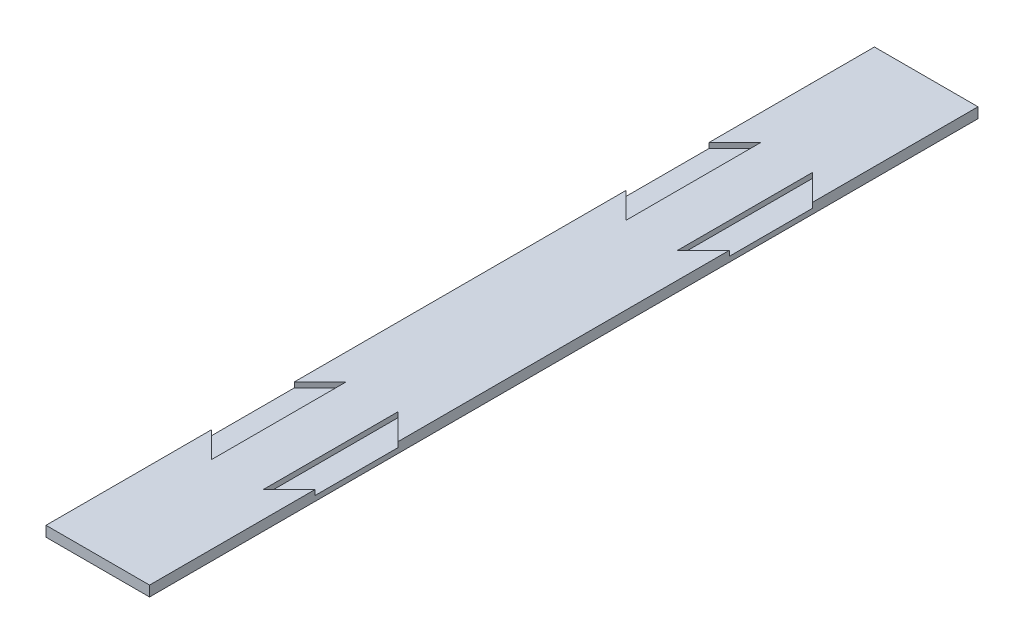
ISO-10303-21;
HEADER;
FILE_DESCRIPTION(('STEP AP214'),'2;1');
FILE_NAME('part.step','',(''),(''),'','','');
FILE_SCHEMA(('AUTOMOTIVE_DESIGN { 1 0 10303 214 1 1 1 1 }'));
ENDSEC;
DATA;
#1=APPLICATION_CONTEXT('core data for automotive mechanical design processes');
#2=APPLICATION_PROTOCOL_DEFINITION('international standard','automotive_design',2000,#1);
#3=PRODUCT_CONTEXT('',#1,'mechanical');
#4=PRODUCT('Part','Part','',(#3));
#5=PRODUCT_RELATED_PRODUCT_CATEGORY('part','',(#4));
#6=PRODUCT_DEFINITION_FORMATION('','',#4);
#7=PRODUCT_DEFINITION_CONTEXT('part definition',#1,'design');
#8=PRODUCT_DEFINITION('design','',#6,#7);
#9=PRODUCT_DEFINITION_SHAPE('','',#8);
#10=(LENGTH_UNIT() NAMED_UNIT(*) SI_UNIT(.MILLI.,.METRE.));
#11=(NAMED_UNIT(*) PLANE_ANGLE_UNIT() SI_UNIT($,.RADIAN.));
#12=(NAMED_UNIT(*) SI_UNIT($,.STERADIAN.) SOLID_ANGLE_UNIT());
#13=UNCERTAINTY_MEASURE_WITH_UNIT(LENGTH_MEASURE(1.E-05),#10,'distance_accuracy_value','');
#14=(GEOMETRIC_REPRESENTATION_CONTEXT(3) GLOBAL_UNCERTAINTY_ASSIGNED_CONTEXT((#13)) GLOBAL_UNIT_ASSIGNED_CONTEXT((#10,
#11,#12)) REPRESENTATION_CONTEXT('',''));
#15=CARTESIAN_POINT('',(0.,0.,0.));
#16=DIRECTION('',(0.,0.,1.));
#17=DIRECTION('',(1.,0.,0.));
#18=AXIS2_PLACEMENT_3D('',#15,#16,#17);
#19=CARTESIAN_POINT('',(12.7,-2.54,101.6));
#20=DIRECTION('',(1.,0.,0.));
#21=DIRECTION('',(0.,0.,-1.));
#22=AXIS2_PLACEMENT_3D('',#19,#20,#21);
#23=PLANE('',#22);
#24=DIRECTION('',(0.,1.,0.));
#25=VECTOR('',#24,1.);
#26=CARTESIAN_POINT('',(12.7,-1.27,40.64));
#27=LINE('',#26,#25);
#28=CARTESIAN_POINT('',(12.7,-1.27,40.64));
#29=VERTEX_POINT('',#28);
#30=CARTESIAN_POINT('',(12.7,0.,40.64));
#31=VERTEX_POINT('',#30);
#32=EDGE_CURVE('E200',#29,#31,#27,.T.);
#33=ORIENTED_EDGE('',*,*,#32,.F.);
#34=DIRECTION('',(0.,0.,-1.));
#35=VECTOR('',#34,1.);
#36=CARTESIAN_POINT('',(12.7,-1.27,60.96));
#37=LINE('',#36,#35);
#38=CARTESIAN_POINT('',(12.7,-1.27,60.96));
#39=VERTEX_POINT('',#38);
#40=EDGE_CURVE('E257',#39,#29,#37,.T.);
#41=ORIENTED_EDGE('',*,*,#40,.F.);
#42=DIRECTION('',(0.,1.,0.));
#43=VECTOR('',#42,1.);
#44=CARTESIAN_POINT('',(12.7,-1.27,60.96));
#45=LINE('',#44,#43);
#46=CARTESIAN_POINT('',(12.7,0.,60.96));
#47=VERTEX_POINT('',#46);
#48=EDGE_CURVE('E244',#39,#47,#45,.T.);
#49=ORIENTED_EDGE('',*,*,#48,.T.);
#50=DIRECTION('',(0.,0.,-1.));
#51=VECTOR('',#50,1.);
#52=CARTESIAN_POINT('',(12.7,0.,101.6));
#53=LINE('',#52,#51);
#54=CARTESIAN_POINT('',(12.7,0.,101.6));
#55=VERTEX_POINT('',#54);
#56=EDGE_CURVE('E306',#55,#47,#53,.T.);
#57=ORIENTED_EDGE('',*,*,#56,.F.);
#58=DIRECTION('',(0.,1.,0.));
#59=VECTOR('',#58,1.);
#60=CARTESIAN_POINT('',(12.7,-2.54,101.6));
#61=LINE('',#60,#59);
#62=CARTESIAN_POINT('',(12.7,-2.54,101.6));
#63=VERTEX_POINT('',#62);
#64=EDGE_CURVE('E11',#63,#55,#61,.T.);
#65=ORIENTED_EDGE('',*,*,#64,.F.);
#66=DIRECTION('',(0.,0.,-1.));
#67=VECTOR('',#66,1.);
#68=CARTESIAN_POINT('',(12.7,-2.54,101.6));
#69=LINE('',#68,#67);
#70=CARTESIAN_POINT('',(12.7,-2.54,-101.6));
#71=VERTEX_POINT('',#70);
#72=EDGE_CURVE('E293',#63,#71,#69,.T.);
#73=ORIENTED_EDGE('',*,*,#72,.T.);
#74=DIRECTION('',(0.,1.,0.));
#75=VECTOR('',#74,1.);
#76=CARTESIAN_POINT('',(12.7,-2.54,-101.6));
#77=LINE('',#76,#75);
#78=CARTESIAN_POINT('',(12.7,0.,-101.6));
#79=VERTEX_POINT('',#78);
#80=EDGE_CURVE('E39',#71,#79,#77,.T.);
#81=ORIENTED_EDGE('',*,*,#80,.T.);
#82=CARTESIAN_POINT('',(12.7,0.,-60.96));
#83=VERTEX_POINT('',#82);
#84=EDGE_CURVE('E287',#83,#79,#53,.T.);
#85=ORIENTED_EDGE('',*,*,#84,.F.);
#86=DIRECTION('',(0.,1.,0.));
#87=VECTOR('',#86,1.);
#88=CARTESIAN_POINT('',(12.7,-1.27,-60.96));
#89=LINE('',#88,#87);
#90=CARTESIAN_POINT('',(12.7,-1.27,-60.96));
#91=VERTEX_POINT('',#90);
#92=EDGE_CURVE('E277',#91,#83,#89,.T.);
#93=ORIENTED_EDGE('',*,*,#92,.F.);
#94=DIRECTION('',(0.,0.,-1.));
#95=VECTOR('',#94,1.);
#96=CARTESIAN_POINT('',(12.7,-1.27,-60.96));
#97=LINE('',#96,#95);
#98=CARTESIAN_POINT('',(12.7,-1.27,-40.64));
#99=VERTEX_POINT('',#98);
#100=EDGE_CURVE('E264',#99,#91,#97,.T.);
#101=ORIENTED_EDGE('',*,*,#100,.F.);
#102=DIRECTION('',(0.,1.,0.));
#103=VECTOR('',#102,1.);
#104=CARTESIAN_POINT('',(12.7,-1.27,-40.64));
#105=LINE('',#104,#103);
#106=CARTESIAN_POINT('',(12.7,0.,-40.64));
#107=VERTEX_POINT('',#106);
#108=EDGE_CURVE('E284',#99,#107,#105,.T.);
#109=ORIENTED_EDGE('',*,*,#108,.T.);
#110=EDGE_CURVE('E310',#31,#107,#53,.T.);
#111=ORIENTED_EDGE('',*,*,#110,.F.);
#112=EDGE_LOOP('',(#33,#41,#49,#57,#65,#73,#81,#85,#93,#101,#109,#111));
#113=FACE_BOUND('',#112,.T.);
#114=ADVANCED_FACE('F36',(#113),#23,.T.);
#115=CARTESIAN_POINT('',(-12.7,-2.54,101.6));
#116=DIRECTION('',(0.,0.,1.));
#117=DIRECTION('',(1.,0.,0.));
#118=AXIS2_PLACEMENT_3D('',#115,#116,#117);
#119=PLANE('',#118);
#120=DIRECTION('',(1.,0.,0.));
#121=VECTOR('',#120,1.);
#122=CARTESIAN_POINT('',(-12.7,0.,101.6));
#123=LINE('',#122,#121);
#124=CARTESIAN_POINT('',(-12.7,0.,101.6));
#125=VERTEX_POINT('',#124);
#126=EDGE_CURVE('E297',#125,#55,#123,.T.);
#127=ORIENTED_EDGE('',*,*,#126,.F.);
#128=DIRECTION('',(0.,1.,0.));
#129=VECTOR('',#128,1.);
#130=CARTESIAN_POINT('',(-12.7,-2.54,101.6));
#131=LINE('',#130,#129);
#132=CARTESIAN_POINT('',(-12.7,-2.54,101.6));
#133=VERTEX_POINT('',#132);
#134=EDGE_CURVE('E44',#133,#125,#131,.T.);
#135=ORIENTED_EDGE('',*,*,#134,.F.);
#136=DIRECTION('',(1.,0.,0.));
#137=VECTOR('',#136,1.);
#138=CARTESIAN_POINT('',(-12.7,-2.54,101.6));
#139=LINE('',#138,#137);
#140=EDGE_CURVE('E303',#133,#63,#139,.T.);
#141=ORIENTED_EDGE('',*,*,#140,.T.);
#142=ORIENTED_EDGE('',*,*,#64,.T.);
#143=EDGE_LOOP('',(#127,#135,#141,#142));
#144=FACE_BOUND('',#143,.T.);
#145=ADVANCED_FACE('F361',(#144),#119,.T.);
#146=CARTESIAN_POINT('',(-12.7,-2.54,101.6));
#147=DIRECTION('',(-1.,0.,0.));
#148=DIRECTION('',(0.,0.,1.));
#149=AXIS2_PLACEMENT_3D('',#146,#147,#148);
#150=PLANE('',#149);
#151=DIRECTION('',(0.,1.,0.));
#152=VECTOR('',#151,1.);
#153=CARTESIAN_POINT('',(-12.7,-1.27,-40.64));
#154=LINE('',#153,#152);
#155=CARTESIAN_POINT('',(-12.7,-1.27,-40.64));
#156=VERTEX_POINT('',#155);
#157=CARTESIAN_POINT('',(-12.7,0.,-40.64));
#158=VERTEX_POINT('',#157);
#159=EDGE_CURVE('E220',#156,#158,#154,.T.);
#160=ORIENTED_EDGE('',*,*,#159,.F.);
#161=DIRECTION('',(0.,0.,1.));
#162=VECTOR('',#161,1.);
#163=CARTESIAN_POINT('',(-12.7,-1.27,-60.96));
#164=LINE('',#163,#162);
#165=CARTESIAN_POINT('',(-12.7,-1.27,-60.96));
#166=VERTEX_POINT('',#165);
#167=EDGE_CURVE('E234',#166,#156,#164,.T.);
#168=ORIENTED_EDGE('',*,*,#167,.F.);
#169=DIRECTION('',(0.,1.,0.));
#170=VECTOR('',#169,1.);
#171=CARTESIAN_POINT('',(-12.7,-1.27,-60.96));
#172=LINE('',#171,#170);
#173=CARTESIAN_POINT('',(-12.7,0.,-60.96));
#174=VERTEX_POINT('',#173);
#175=EDGE_CURVE('E217',#166,#174,#172,.T.);
#176=ORIENTED_EDGE('',*,*,#175,.T.);
#177=DIRECTION('',(0.,0.,1.));
#178=VECTOR('',#177,1.);
#179=CARTESIAN_POINT('',(-12.7,0.,101.6));
#180=LINE('',#179,#178);
#181=CARTESIAN_POINT('',(-12.7,0.,-101.6));
#182=VERTEX_POINT('',#181);
#183=EDGE_CURVE('E314',#182,#174,#180,.T.);
#184=ORIENTED_EDGE('',*,*,#183,.F.);
#185=DIRECTION('',(0.,1.,0.));
#186=VECTOR('',#185,1.);
#187=CARTESIAN_POINT('',(-12.7,-2.54,-101.6));
#188=LINE('',#187,#186);
#189=CARTESIAN_POINT('',(-12.7,-2.54,-101.6));
#190=VERTEX_POINT('',#189);
#191=EDGE_CURVE('E320',#190,#182,#188,.T.);
#192=ORIENTED_EDGE('',*,*,#191,.F.);
#193=DIRECTION('',(0.,0.,1.));
#194=VECTOR('',#193,1.);
#195=CARTESIAN_POINT('',(-12.7,-2.54,101.6));
#196=LINE('',#195,#194);
#197=EDGE_CURVE('E300',#190,#133,#196,.T.);
#198=ORIENTED_EDGE('',*,*,#197,.T.);
#199=ORIENTED_EDGE('',*,*,#134,.T.);
#200=CARTESIAN_POINT('',(-12.7,0.,60.96));
#201=VERTEX_POINT('',#200);
#202=EDGE_CURVE('E313',#201,#125,#180,.T.);
#203=ORIENTED_EDGE('',*,*,#202,.F.);
#204=DIRECTION('',(0.,1.,0.));
#205=VECTOR('',#204,1.);
#206=CARTESIAN_POINT('',(-12.7,-1.27,60.96));
#207=LINE('',#206,#205);
#208=CARTESIAN_POINT('',(-12.7,-1.27,60.96));
#209=VERTEX_POINT('',#208);
#210=EDGE_CURVE('E401',#209,#201,#207,.T.);
#211=ORIENTED_EDGE('',*,*,#210,.F.);
#212=DIRECTION('',(0.,0.,1.));
#213=VECTOR('',#212,1.);
#214=CARTESIAN_POINT('',(-12.7,-1.27,60.96));
#215=LINE('',#214,#213);
#216=CARTESIAN_POINT('',(-12.7,-1.27,40.64));
#217=VERTEX_POINT('',#216);
#218=EDGE_CURVE('E210',#217,#209,#215,.T.);
#219=ORIENTED_EDGE('',*,*,#218,.F.);
#220=DIRECTION('',(0.,1.,0.));
#221=VECTOR('',#220,1.);
#222=CARTESIAN_POINT('',(-12.7,-1.27,40.64));
#223=LINE('',#222,#221);
#224=CARTESIAN_POINT('',(-12.7,0.,40.64));
#225=VERTEX_POINT('',#224);
#226=EDGE_CURVE('E207',#217,#225,#223,.T.);
#227=ORIENTED_EDGE('',*,*,#226,.T.);
#228=EDGE_CURVE('E197',#158,#225,#180,.T.);
#229=ORIENTED_EDGE('',*,*,#228,.F.);
#230=EDGE_LOOP('',(#160,#168,#176,#184,#192,#198,#199,#203,#211,#219,#227,#229));
#231=FACE_BOUND('',#230,.T.);
#232=ADVANCED_FACE('F365',(#231),#150,.T.);
#233=CARTESIAN_POINT('',(-12.7,-2.54,-101.6));
#234=DIRECTION('',(0.,0.,-1.));
#235=DIRECTION('',(-1.,0.,0.));
#236=AXIS2_PLACEMENT_3D('',#233,#234,#235);
#237=PLANE('',#236);
#238=DIRECTION('',(-1.,0.,0.));
#239=VECTOR('',#238,1.);
#240=CARTESIAN_POINT('',(-12.7,0.,-101.6));
#241=LINE('',#240,#239);
#242=EDGE_CURVE('E309',#79,#182,#241,.T.);
#243=ORIENTED_EDGE('',*,*,#242,.F.);
#244=ORIENTED_EDGE('',*,*,#80,.F.);
#245=DIRECTION('',(-1.,0.,0.));
#246=VECTOR('',#245,1.);
#247=CARTESIAN_POINT('',(-12.7,-2.54,-101.6));
#248=LINE('',#247,#246);
#249=EDGE_CURVE('E296',#71,#190,#248,.T.);
#250=ORIENTED_EDGE('',*,*,#249,.T.);
#251=ORIENTED_EDGE('',*,*,#191,.T.);
#252=EDGE_LOOP('',(#243,#244,#250,#251));
#253=FACE_BOUND('',#252,.T.);
#254=ADVANCED_FACE('F331',(#253),#237,.T.);
#255=CARTESIAN_POINT('',(0.,-2.54,0.));
#256=DIRECTION('',(0.,-1.,0.));
#257=DIRECTION('',(0.,0.,-1.));
#258=AXIS2_PLACEMENT_3D('',#255,#256,#257);
#259=PLANE('',#258);
#260=ORIENTED_EDGE('',*,*,#72,.F.);
#261=ORIENTED_EDGE('',*,*,#140,.F.);
#262=ORIENTED_EDGE('',*,*,#197,.F.);
#263=ORIENTED_EDGE('',*,*,#249,.F.);
#264=EDGE_LOOP('',(#260,#261,#262,#263));
#265=FACE_BOUND('',#264,.T.);
#266=ADVANCED_FACE('F376',(#265),#259,.T.);
#267=CARTESIAN_POINT('',(0.,0.,0.));
#268=DIRECTION('',(0.,-1.,0.));
#269=DIRECTION('',(0.,0.,-1.));
#270=AXIS2_PLACEMENT_3D('',#267,#268,#269);
#271=PLANE('',#270);
#272=DIRECTION('',(0.,0.,-1.));
#273=VECTOR('',#272,1.);
#274=CARTESIAN_POINT('',(-6.35000000000001,0.,-34.2899999999999));
#275=LINE('',#274,#273);
#276=CARTESIAN_POINT('',(-6.35000000000001,0.,-34.2899999999999));
#277=VERTEX_POINT('',#276);
#278=CARTESIAN_POINT('',(-6.35000000000001,0.,-67.31));
#279=VERTEX_POINT('',#278);
#280=EDGE_CURVE('E52',#277,#279,#275,.T.);
#281=ORIENTED_EDGE('',*,*,#280,.F.);
#282=DIRECTION('',(0.707106781186544,0.,0.707106781186551));
#283=VECTOR('',#282,1.);
#284=CARTESIAN_POINT('',(-12.7,0.,-40.64));
#285=LINE('',#284,#283);
#286=EDGE_CURVE('E224',#158,#277,#285,.T.);
#287=ORIENTED_EDGE('',*,*,#286,.F.);
#288=ORIENTED_EDGE('',*,*,#228,.T.);
#289=DIRECTION('',(-0.707106781186544,0.,0.707106781186551));
#290=VECTOR('',#289,1.);
#291=CARTESIAN_POINT('',(-12.7,0.,40.64));
#292=LINE('',#291,#290);
#293=CARTESIAN_POINT('',(-6.35000000000001,0.,34.2899999999999));
#294=VERTEX_POINT('',#293);
#295=EDGE_CURVE('E176',#294,#225,#292,.T.);
#296=ORIENTED_EDGE('',*,*,#295,.F.);
#297=DIRECTION('',(0.,0.,-1.));
#298=VECTOR('',#297,1.);
#299=CARTESIAN_POINT('',(-6.35000000000001,0.,34.2899999999999));
#300=LINE('',#299,#298);
#301=CARTESIAN_POINT('',(-6.35000000000001,0.,67.31));
#302=VERTEX_POINT('',#301);
#303=EDGE_CURVE('E186',#302,#294,#300,.T.);
#304=ORIENTED_EDGE('',*,*,#303,.F.);
#305=DIRECTION('',(0.707106781186545,0.,0.70710678118655));
#306=VECTOR('',#305,1.);
#307=CARTESIAN_POINT('',(-6.35000000000001,0.,67.31));
#308=LINE('',#307,#306);
#309=EDGE_CURVE('E191',#201,#302,#308,.T.);
#310=ORIENTED_EDGE('',*,*,#309,.F.);
#311=ORIENTED_EDGE('',*,*,#202,.T.);
#312=ORIENTED_EDGE('',*,*,#126,.T.);
#313=ORIENTED_EDGE('',*,*,#56,.T.);
#314=DIRECTION('',(0.707106781186544,0.,-0.707106781186551));
#315=VECTOR('',#314,1.);
#316=CARTESIAN_POINT('',(6.35000000000001,0.,67.3100000000001));
#317=LINE('',#316,#315);
#318=CARTESIAN_POINT('',(6.35000000000001,0.,67.3100000000001));
#319=VERTEX_POINT('',#318);
#320=EDGE_CURVE('E251',#319,#47,#317,.T.);
#321=ORIENTED_EDGE('',*,*,#320,.F.);
#322=DIRECTION('',(0.,0.,1.));
#323=VECTOR('',#322,1.);
#324=CARTESIAN_POINT('',(6.35000000000001,0.,34.2899999999999));
#325=LINE('',#324,#323);
#326=CARTESIAN_POINT('',(6.35000000000001,0.,34.2899999999999));
#327=VERTEX_POINT('',#326);
#328=EDGE_CURVE('E60',#327,#319,#325,.T.);
#329=ORIENTED_EDGE('',*,*,#328,.F.);
#330=DIRECTION('',(-0.707106781186544,0.,-0.707106781186551));
#331=VECTOR('',#330,1.);
#332=CARTESIAN_POINT('',(12.7,0.,40.64));
#333=LINE('',#332,#331);
#334=EDGE_CURVE('E248',#31,#327,#333,.T.);
#335=ORIENTED_EDGE('',*,*,#334,.F.);
#336=ORIENTED_EDGE('',*,*,#110,.T.);
#337=DIRECTION('',(0.707106781186544,0.,-0.707106781186551));
#338=VECTOR('',#337,1.);
#339=CARTESIAN_POINT('',(12.7,0.,-40.64));
#340=LINE('',#339,#338);
#341=CARTESIAN_POINT('',(6.35000000000001,0.,-34.2899999999999));
#342=VERTEX_POINT('',#341);
#343=EDGE_CURVE('E268',#342,#107,#340,.T.);
#344=ORIENTED_EDGE('',*,*,#343,.F.);
#345=DIRECTION('',(0.,0.,1.));
#346=VECTOR('',#345,1.);
#347=CARTESIAN_POINT('',(6.35000000000001,0.,-34.2899999999999));
#348=LINE('',#347,#346);
#349=CARTESIAN_POINT('',(6.35000000000001,0.,-67.3100000000001));
#350=VERTEX_POINT('',#349);
#351=EDGE_CURVE('E280',#350,#342,#348,.T.);
#352=ORIENTED_EDGE('',*,*,#351,.F.);
#353=DIRECTION('',(-0.707106781186544,0.,-0.707106781186551));
#354=VECTOR('',#353,1.);
#355=CARTESIAN_POINT('',(6.35000000000001,0.,-67.3100000000001));
#356=LINE('',#355,#354);
#357=EDGE_CURVE('E231',#83,#350,#356,.T.);
#358=ORIENTED_EDGE('',*,*,#357,.F.);
#359=ORIENTED_EDGE('',*,*,#84,.T.);
#360=ORIENTED_EDGE('',*,*,#242,.T.);
#361=ORIENTED_EDGE('',*,*,#183,.T.);
#362=DIRECTION('',(-0.707106781186545,0.,0.70710678118655));
#363=VECTOR('',#362,1.);
#364=CARTESIAN_POINT('',(-6.35000000000001,0.,-67.31));
#365=LINE('',#364,#363);
#366=EDGE_CURVE('E227',#279,#174,#365,.T.);
#367=ORIENTED_EDGE('',*,*,#366,.F.);
#368=EDGE_LOOP('',(#281,#287,#288,#296,#304,#310,#311,#312,#313,#321,#329,#335,#336,#344,#352,
#358,#359,#360,#361,#367));
#369=FACE_BOUND('',#368,.T.);
#370=ADVANCED_FACE('F194',(#369),#271,.F.);
#371=CARTESIAN_POINT('',(12.7,-1.27,-40.64));
#372=DIRECTION('',(0.707106781186551,0.,0.707106781186544));
#373=DIRECTION('',(0.707106781186544,0.,-0.707106781186551));
#374=AXIS2_PLACEMENT_3D('',#371,#372,#373);
#375=PLANE('',#374);
#376=ORIENTED_EDGE('',*,*,#343,.T.);
#377=ORIENTED_EDGE('',*,*,#108,.F.);
#378=DIRECTION('',(0.707106781186544,0.,-0.707106781186551));
#379=VECTOR('',#378,1.);
#380=CARTESIAN_POINT('',(12.7,-1.27,-40.64));
#381=LINE('',#380,#379);
#382=CARTESIAN_POINT('',(6.35000000000001,-1.27,-34.2899999999999));
#383=VERTEX_POINT('',#382);
#384=EDGE_CURVE('E274',#383,#99,#381,.T.);
#385=ORIENTED_EDGE('',*,*,#384,.F.);
#386=DIRECTION('',(0.,1.,0.));
#387=VECTOR('',#386,1.);
#388=CARTESIAN_POINT('',(6.35000000000001,-1.27,-34.2899999999999));
#389=LINE('',#388,#387);
#390=EDGE_CURVE('E288',#383,#342,#389,.T.);
#391=ORIENTED_EDGE('',*,*,#390,.T.);
#392=EDGE_LOOP('',(#376,#377,#385,#391));
#393=FACE_BOUND('',#392,.T.);
#394=ADVANCED_FACE('F343',(#393),#375,.F.);
#395=CARTESIAN_POINT('',(6.35000000000001,-1.27,-34.2899999999999));
#396=DIRECTION('',(-1.,0.,0.));
#397=DIRECTION('',(0.,0.,1.));
#398=AXIS2_PLACEMENT_3D('',#395,#396,#397);
#399=PLANE('',#398);
#400=ORIENTED_EDGE('',*,*,#351,.T.);
#401=ORIENTED_EDGE('',*,*,#390,.F.);
#402=DIRECTION('',(0.,0.,1.));
#403=VECTOR('',#402,1.);
#404=CARTESIAN_POINT('',(6.35000000000001,-1.27,-34.2899999999999));
#405=LINE('',#404,#403);
#406=CARTESIAN_POINT('',(6.35000000000001,-1.27,-67.3100000000001));
#407=VERTEX_POINT('',#406);
#408=EDGE_CURVE('E271',#407,#383,#405,.T.);
#409=ORIENTED_EDGE('',*,*,#408,.F.);
#410=DIRECTION('',(0.,1.,0.));
#411=VECTOR('',#410,1.);
#412=CARTESIAN_POINT('',(6.35000000000001,-1.27,-67.3100000000001));
#413=LINE('',#412,#411);
#414=EDGE_CURVE('E290',#407,#350,#413,.T.);
#415=ORIENTED_EDGE('',*,*,#414,.T.);
#416=EDGE_LOOP('',(#400,#401,#409,#415));
#417=FACE_BOUND('',#416,.T.);
#418=ADVANCED_FACE('F348',(#417),#399,.F.);
#419=CARTESIAN_POINT('',(6.35000000000001,-1.27,-67.3100000000001));
#420=DIRECTION('',(0.707106781186551,0.,-0.707106781186544));
#421=DIRECTION('',(-0.707106781186544,0.,-0.707106781186551));
#422=AXIS2_PLACEMENT_3D('',#419,#420,#421);
#423=PLANE('',#422);
#424=ORIENTED_EDGE('',*,*,#357,.T.);
#425=ORIENTED_EDGE('',*,*,#414,.F.);
#426=DIRECTION('',(-0.707106781186544,0.,-0.707106781186551));
#427=VECTOR('',#426,1.);
#428=CARTESIAN_POINT('',(6.35000000000001,-1.27,-67.3100000000001));
#429=LINE('',#428,#427);
#430=EDGE_CURVE('E267',#91,#407,#429,.T.);
#431=ORIENTED_EDGE('',*,*,#430,.F.);
#432=ORIENTED_EDGE('',*,*,#92,.T.);
#433=EDGE_LOOP('',(#424,#425,#431,#432));
#434=FACE_BOUND('',#433,.T.);
#435=ADVANCED_FACE('F350',(#434),#423,.F.);
#436=CARTESIAN_POINT('',(0.,-1.27,0.));
#437=DIRECTION('',(0.,-1.,0.));
#438=DIRECTION('',(0.,0.,-1.));
#439=AXIS2_PLACEMENT_3D('',#436,#437,#438);
#440=PLANE('',#439);
#441=ORIENTED_EDGE('',*,*,#100,.T.);
#442=ORIENTED_EDGE('',*,*,#430,.T.);
#443=ORIENTED_EDGE('',*,*,#408,.T.);
#444=ORIENTED_EDGE('',*,*,#384,.T.);
#445=EDGE_LOOP('',(#441,#442,#443,#444));
#446=FACE_BOUND('',#445,.T.);
#447=ADVANCED_FACE('F345',(#446),#440,.F.);
#448=CARTESIAN_POINT('',(-12.7,-1.27,40.64));
#449=DIRECTION('',(-0.707106781186551,0.,-0.707106781186544));
#450=DIRECTION('',(-0.707106781186544,0.,0.707106781186551));
#451=AXIS2_PLACEMENT_3D('',#448,#449,#450);
#452=PLANE('',#451);
#453=ORIENTED_EDGE('',*,*,#295,.T.);
#454=ORIENTED_EDGE('',*,*,#226,.F.);
#455=DIRECTION('',(-0.707106781186544,0.,0.707106781186551));
#456=VECTOR('',#455,1.);
#457=CARTESIAN_POINT('',(-12.7,-1.27,40.64));
#458=LINE('',#457,#456);
#459=CARTESIAN_POINT('',(-6.35000000000001,-1.27,34.2899999999999));
#460=VERTEX_POINT('',#459);
#461=EDGE_CURVE('E179',#460,#217,#458,.T.);
#462=ORIENTED_EDGE('',*,*,#461,.F.);
#463=DIRECTION('',(0.,1.,0.));
#464=VECTOR('',#463,1.);
#465=CARTESIAN_POINT('',(-6.35000000000001,-1.27,34.2899999999999));
#466=LINE('',#465,#464);
#467=EDGE_CURVE('E172',#460,#294,#466,.T.);
#468=ORIENTED_EDGE('',*,*,#467,.T.);
#469=EDGE_LOOP('',(#453,#454,#462,#468));
#470=FACE_BOUND('',#469,.T.);
#471=ADVANCED_FACE('F174',(#470),#452,.F.);
#472=CARTESIAN_POINT('',(-6.35000000000001,-1.27,34.2899999999999));
#473=DIRECTION('',(1.,0.,0.));
#474=DIRECTION('',(0.,0.,-1.));
#475=AXIS2_PLACEMENT_3D('',#472,#473,#474);
#476=PLANE('',#475);
#477=ORIENTED_EDGE('',*,*,#303,.T.);
#478=ORIENTED_EDGE('',*,*,#467,.F.);
#479=DIRECTION('',(0.,0.,-1.));
#480=VECTOR('',#479,1.);
#481=CARTESIAN_POINT('',(-6.35000000000001,-1.27,34.2899999999999));
#482=LINE('',#481,#480);
#483=CARTESIAN_POINT('',(-6.35000000000001,-1.27,67.31));
#484=VERTEX_POINT('',#483);
#485=EDGE_CURVE('E204',#484,#460,#482,.T.);
#486=ORIENTED_EDGE('',*,*,#485,.F.);
#487=DIRECTION('',(0.,1.,0.));
#488=VECTOR('',#487,1.);
#489=CARTESIAN_POINT('',(-6.35000000000001,-1.27,67.31));
#490=LINE('',#489,#488);
#491=EDGE_CURVE('E183',#484,#302,#490,.T.);
#492=ORIENTED_EDGE('',*,*,#491,.T.);
#493=EDGE_LOOP('',(#477,#478,#486,#492));
#494=FACE_BOUND('',#493,.T.);
#495=ADVANCED_FACE('F187',(#494),#476,.F.);
#496=CARTESIAN_POINT('',(-6.35000000000001,-1.27,67.31));
#497=DIRECTION('',(-0.70710678118655,0.,0.707106781186545));
#498=DIRECTION('',(0.707106781186545,0.,0.70710678118655));
#499=AXIS2_PLACEMENT_3D('',#496,#497,#498);
#500=PLANE('',#499);
#501=ORIENTED_EDGE('',*,*,#309,.T.);
#502=ORIENTED_EDGE('',*,*,#491,.F.);
#503=DIRECTION('',(0.707106781186545,0.,0.70710678118655));
#504=VECTOR('',#503,1.);
#505=CARTESIAN_POINT('',(-6.35000000000001,-1.27,67.31));
#506=LINE('',#505,#504);
#507=EDGE_CURVE('E206',#209,#484,#506,.T.);
#508=ORIENTED_EDGE('',*,*,#507,.F.);
#509=ORIENTED_EDGE('',*,*,#210,.T.);
#510=EDGE_LOOP('',(#501,#502,#508,#509));
#511=FACE_BOUND('',#510,.T.);
#512=ADVANCED_FACE('F406',(#511),#500,.F.);
#513=CARTESIAN_POINT('',(0.,-1.27,0.));
#514=DIRECTION('',(0.,1.,0.));
#515=DIRECTION('',(0.,0.,1.));
#516=AXIS2_PLACEMENT_3D('',#513,#514,#515);
#517=PLANE('',#516);
#518=ORIENTED_EDGE('',*,*,#461,.T.);
#519=ORIENTED_EDGE('',*,*,#218,.T.);
#520=ORIENTED_EDGE('',*,*,#507,.T.);
#521=ORIENTED_EDGE('',*,*,#485,.T.);
#522=EDGE_LOOP('',(#518,#519,#520,#521));
#523=FACE_BOUND('',#522,.T.);
#524=ADVANCED_FACE('F408',(#523),#517,.T.);
#525=CARTESIAN_POINT('',(6.35000000000001,-1.27,34.2899999999999));
#526=DIRECTION('',(-1.,0.,0.));
#527=DIRECTION('',(0.,0.,1.));
#528=AXIS2_PLACEMENT_3D('',#525,#526,#527);
#529=PLANE('',#528);
#530=ORIENTED_EDGE('',*,*,#328,.T.);
#531=DIRECTION('',(0.,1.,0.));
#532=VECTOR('',#531,1.);
#533=CARTESIAN_POINT('',(6.35000000000001,-1.27,67.3100000000001));
#534=LINE('',#533,#532);
#535=CARTESIAN_POINT('',(6.35000000000001,-1.27,67.3100000000001));
#536=VERTEX_POINT('',#535);
#537=EDGE_CURVE('E241',#536,#319,#534,.T.);
#538=ORIENTED_EDGE('',*,*,#537,.F.);
#539=DIRECTION('',(0.,0.,1.));
#540=VECTOR('',#539,1.);
#541=CARTESIAN_POINT('',(6.35000000000001,-1.27,34.2899999999999));
#542=LINE('',#541,#540);
#543=CARTESIAN_POINT('',(6.35000000000001,-1.27,34.2899999999999));
#544=VERTEX_POINT('',#543);
#545=EDGE_CURVE('E252',#544,#536,#542,.T.);
#546=ORIENTED_EDGE('',*,*,#545,.F.);
#547=DIRECTION('',(0.,1.,0.));
#548=VECTOR('',#547,1.);
#549=CARTESIAN_POINT('',(6.35000000000001,-1.27,34.2899999999999));
#550=LINE('',#549,#548);
#551=EDGE_CURVE('E198',#544,#327,#550,.T.);
#552=ORIENTED_EDGE('',*,*,#551,.T.);
#553=EDGE_LOOP('',(#530,#538,#546,#552));
#554=FACE_BOUND('',#553,.T.);
#555=ADVANCED_FACE('F410',(#554),#529,.F.);
#556=CARTESIAN_POINT('',(12.7,-1.27,40.64));
#557=DIRECTION('',(0.707106781186551,0.,-0.707106781186544));
#558=DIRECTION('',(-0.707106781186544,0.,-0.707106781186551));
#559=AXIS2_PLACEMENT_3D('',#556,#557,#558);
#560=PLANE('',#559);
#561=ORIENTED_EDGE('',*,*,#334,.T.);
#562=ORIENTED_EDGE('',*,*,#551,.F.);
#563=DIRECTION('',(-0.707106781186544,0.,-0.707106781186551));
#564=VECTOR('',#563,1.);
#565=CARTESIAN_POINT('',(12.7,-1.27,40.64));
#566=LINE('',#565,#564);
#567=EDGE_CURVE('E243',#29,#544,#566,.T.);
#568=ORIENTED_EDGE('',*,*,#567,.F.);
#569=ORIENTED_EDGE('',*,*,#32,.T.);
#570=EDGE_LOOP('',(#561,#562,#568,#569));
#571=FACE_BOUND('',#570,.T.);
#572=ADVANCED_FACE('F416',(#571),#560,.F.);
#573=CARTESIAN_POINT('',(6.35000000000001,-1.27,67.3100000000001));
#574=DIRECTION('',(0.707106781186551,0.,0.707106781186544));
#575=DIRECTION('',(0.707106781186544,0.,-0.707106781186551));
#576=AXIS2_PLACEMENT_3D('',#573,#574,#575);
#577=PLANE('',#576);
#578=ORIENTED_EDGE('',*,*,#320,.T.);
#579=ORIENTED_EDGE('',*,*,#48,.F.);
#580=DIRECTION('',(0.707106781186544,0.,-0.707106781186551));
#581=VECTOR('',#580,1.);
#582=CARTESIAN_POINT('',(6.35000000000001,-1.27,67.3100000000001));
#583=LINE('',#582,#581);
#584=EDGE_CURVE('E259',#536,#39,#583,.T.);
#585=ORIENTED_EDGE('',*,*,#584,.F.);
#586=ORIENTED_EDGE('',*,*,#537,.T.);
#587=EDGE_LOOP('',(#578,#579,#585,#586));
#588=FACE_BOUND('',#587,.T.);
#589=ADVANCED_FACE('F431',(#588),#577,.F.);
#590=CARTESIAN_POINT('',(0.,-1.27,0.));
#591=DIRECTION('',(0.,1.,0.));
#592=DIRECTION('',(0.,0.,1.));
#593=AXIS2_PLACEMENT_3D('',#590,#591,#592);
#594=PLANE('',#593);
#595=ORIENTED_EDGE('',*,*,#545,.T.);
#596=ORIENTED_EDGE('',*,*,#584,.T.);
#597=ORIENTED_EDGE('',*,*,#40,.T.);
#598=ORIENTED_EDGE('',*,*,#567,.T.);
#599=EDGE_LOOP('',(#595,#596,#597,#598));
#600=FACE_BOUND('',#599,.T.);
#601=ADVANCED_FACE('F424',(#600),#594,.T.);
#602=CARTESIAN_POINT('',(-6.35000000000001,-1.27,-34.2899999999999));
#603=DIRECTION('',(1.,0.,0.));
#604=DIRECTION('',(0.,0.,-1.));
#605=AXIS2_PLACEMENT_3D('',#602,#603,#604);
#606=PLANE('',#605);
#607=ORIENTED_EDGE('',*,*,#280,.T.);
#608=DIRECTION('',(0.,1.,0.));
#609=VECTOR('',#608,1.);
#610=CARTESIAN_POINT('',(-6.35000000000001,-1.27,-67.31));
#611=LINE('',#610,#609);
#612=CARTESIAN_POINT('',(-6.35000000000001,-1.27,-67.31));
#613=VERTEX_POINT('',#612);
#614=EDGE_CURVE('E214',#613,#279,#611,.T.);
#615=ORIENTED_EDGE('',*,*,#614,.F.);
#616=DIRECTION('',(0.,0.,-1.));
#617=VECTOR('',#616,1.);
#618=CARTESIAN_POINT('',(-6.35000000000001,-1.27,-34.2899999999999));
#619=LINE('',#618,#617);
#620=CARTESIAN_POINT('',(-6.35000000000001,-1.27,-34.2899999999999));
#621=VERTEX_POINT('',#620);
#622=EDGE_CURVE('E228',#621,#613,#619,.T.);
#623=ORIENTED_EDGE('',*,*,#622,.F.);
#624=DIRECTION('',(0.,1.,0.));
#625=VECTOR('',#624,1.);
#626=CARTESIAN_POINT('',(-6.35000000000001,-1.27,-34.2899999999999));
#627=LINE('',#626,#625);
#628=EDGE_CURVE('E222',#621,#277,#627,.T.);
#629=ORIENTED_EDGE('',*,*,#628,.T.);
#630=EDGE_LOOP('',(#607,#615,#623,#629));
#631=FACE_BOUND('',#630,.T.);
#632=ADVANCED_FACE('F397',(#631),#606,.F.);
#633=CARTESIAN_POINT('',(-12.7,-1.27,-40.64));
#634=DIRECTION('',(-0.707106781186551,0.,0.707106781186544));
#635=DIRECTION('',(0.707106781186544,0.,0.707106781186551));
#636=AXIS2_PLACEMENT_3D('',#633,#634,#635);
#637=PLANE('',#636);
#638=ORIENTED_EDGE('',*,*,#286,.T.);
#639=ORIENTED_EDGE('',*,*,#628,.F.);
#640=DIRECTION('',(0.707106781186544,0.,0.707106781186551));
#641=VECTOR('',#640,1.);
#642=CARTESIAN_POINT('',(-12.7,-1.27,-40.64));
#643=LINE('',#642,#641);
#644=EDGE_CURVE('E216',#156,#621,#643,.T.);
#645=ORIENTED_EDGE('',*,*,#644,.F.);
#646=ORIENTED_EDGE('',*,*,#159,.T.);
#647=EDGE_LOOP('',(#638,#639,#645,#646));
#648=FACE_BOUND('',#647,.T.);
#649=ADVANCED_FACE('F423',(#648),#637,.F.);
#650=CARTESIAN_POINT('',(-6.35000000000001,-1.27,-67.31));
#651=DIRECTION('',(-0.70710678118655,0.,-0.707106781186545));
#652=DIRECTION('',(-0.707106781186545,0.,0.70710678118655));
#653=AXIS2_PLACEMENT_3D('',#650,#651,#652);
#654=PLANE('',#653);
#655=ORIENTED_EDGE('',*,*,#366,.T.);
#656=ORIENTED_EDGE('',*,*,#175,.F.);
#657=DIRECTION('',(-0.707106781186545,0.,0.70710678118655));
#658=VECTOR('',#657,1.);
#659=CARTESIAN_POINT('',(-6.35000000000001,-1.27,-67.31));
#660=LINE('',#659,#658);
#661=EDGE_CURVE('E236',#613,#166,#660,.T.);
#662=ORIENTED_EDGE('',*,*,#661,.F.);
#663=ORIENTED_EDGE('',*,*,#614,.T.);
#664=EDGE_LOOP('',(#655,#656,#662,#663));
#665=FACE_BOUND('',#664,.T.);
#666=ADVANCED_FACE('F392',(#665),#654,.F.);
#667=CARTESIAN_POINT('',(0.,-1.27,0.));
#668=DIRECTION('',(0.,1.,0.));
#669=DIRECTION('',(0.,0.,1.));
#670=AXIS2_PLACEMENT_3D('',#667,#668,#669);
#671=PLANE('',#670);
#672=ORIENTED_EDGE('',*,*,#622,.T.);
#673=ORIENTED_EDGE('',*,*,#661,.T.);
#674=ORIENTED_EDGE('',*,*,#167,.T.);
#675=ORIENTED_EDGE('',*,*,#644,.T.);
#676=EDGE_LOOP('',(#672,#673,#674,#675));
#677=FACE_BOUND('',#676,.T.);
#678=ADVANCED_FACE('F394',(#677),#671,.T.);
#679=CLOSED_SHELL('',(#114,#145,#232,#254,#266,#370,#394,#418,#435,#447,#471,#495,#512,#524,
#555,#572,#589,#601,#632,#649,#666,#678));
#680=MANIFOLD_SOLID_BREP('B2',#679);
#681=ADVANCED_BREP_SHAPE_REPRESENTATION('',(#18,#680),#14);
#682=SHAPE_DEFINITION_REPRESENTATION(#9,#681);
ENDSEC;
END-ISO-10303-21;
